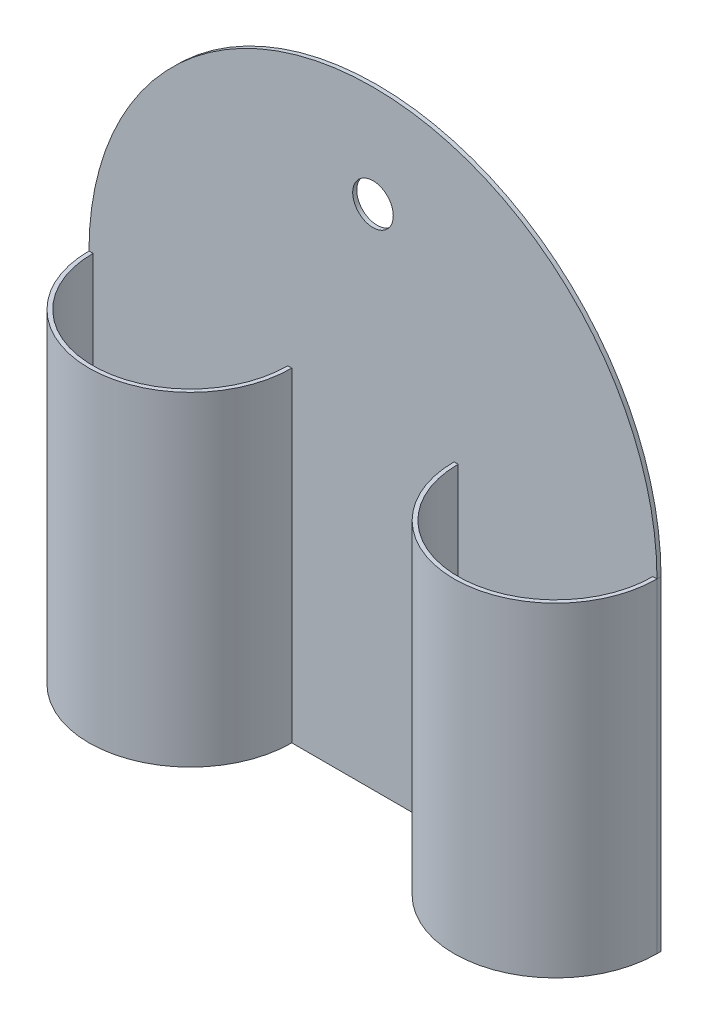
ISO-10303-21;
HEADER;
FILE_DESCRIPTION(('STEP AP214'),'2;1');
FILE_NAME('part.step','',(''),(''),'','','');
FILE_SCHEMA(('AUTOMOTIVE_DESIGN { 1 0 10303 214 1 1 1 1 }'));
ENDSEC;
DATA;
#1=APPLICATION_CONTEXT('core data for automotive mechanical design processes');
#2=APPLICATION_PROTOCOL_DEFINITION('international standard','automotive_design',2000,#1);
#3=PRODUCT_CONTEXT('',#1,'mechanical');
#4=PRODUCT('Part','Part','',(#3));
#5=PRODUCT_RELATED_PRODUCT_CATEGORY('part','',(#4));
#6=PRODUCT_DEFINITION_FORMATION('','',#4);
#7=PRODUCT_DEFINITION_CONTEXT('part definition',#1,'design');
#8=PRODUCT_DEFINITION('design','',#6,#7);
#9=PRODUCT_DEFINITION_SHAPE('','',#8);
#10=(LENGTH_UNIT() NAMED_UNIT(*) SI_UNIT(.MILLI.,.METRE.));
#11=(NAMED_UNIT(*) PLANE_ANGLE_UNIT() SI_UNIT($,.RADIAN.));
#12=(NAMED_UNIT(*) SI_UNIT($,.STERADIAN.) SOLID_ANGLE_UNIT());
#13=UNCERTAINTY_MEASURE_WITH_UNIT(LENGTH_MEASURE(1.E-05),#10,'distance_accuracy_value','');
#14=(GEOMETRIC_REPRESENTATION_CONTEXT(3) GLOBAL_UNCERTAINTY_ASSIGNED_CONTEXT((#13)) GLOBAL_UNIT_ASSIGNED_CONTEXT((#10,
#11,#12)) REPRESENTATION_CONTEXT('',''));
#15=CARTESIAN_POINT('',(0.,0.,0.));
#16=DIRECTION('',(0.,0.,1.));
#17=DIRECTION('',(1.,0.,0.));
#18=AXIS2_PLACEMENT_3D('',#15,#16,#17);
#19=CARTESIAN_POINT('',(70.,80.,1.));
#20=DIRECTION('',(0.,0.,1.));
#21=DIRECTION('',(1.,0.,0.));
#22=AXIS2_PLACEMENT_3D('',#19,#20,#21);
#23=PLANE('',#22);
#24=CARTESIAN_POINT('',(70.,125.,1.));
#25=DIRECTION('',(0.,0.,1.));
#26=DIRECTION('',(1.,0.,0.));
#27=AXIS2_PLACEMENT_3D('',#24,#25,#26);
#28=CIRCLE('',#27,5.00000000000001);
#29=CARTESIAN_POINT('',(75.,125.,1.));
#30=VERTEX_POINT('',#29);
#31=EDGE_CURVE('E161',#30,#30,#28,.T.);
#32=ORIENTED_EDGE('',*,*,#31,.F.);
#33=EDGE_LOOP('',(#32));
#34=FACE_BOUND('',#33,.T.);
#35=DIRECTION('',(1.,0.,0.));
#36=VECTOR('',#35,1.);
#37=CARTESIAN_POINT('',(0.,0.,1.));
#38=LINE('',#37,#36);
#39=CARTESIAN_POINT('',(50.,0.,1.));
#40=VERTEX_POINT('',#39);
#41=CARTESIAN_POINT('',(90.,0.,1.));
#42=VERTEX_POINT('',#41);
#43=EDGE_CURVE('E170',#40,#42,#38,.T.);
#44=ORIENTED_EDGE('',*,*,#43,.T.);
#45=DIRECTION('',(0.,-1.,0.));
#46=VECTOR('',#45,1.);
#47=CARTESIAN_POINT('',(90.,80.,1.));
#48=LINE('',#47,#46);
#49=CARTESIAN_POINT('',(90.,80.,1.));
#50=VERTEX_POINT('',#49);
#51=EDGE_CURVE('E143',#50,#42,#48,.T.);
#52=ORIENTED_EDGE('',*,*,#51,.F.);
#53=DIRECTION('',(-1.,0.,0.));
#54=VECTOR('',#53,1.);
#55=CARTESIAN_POINT('',(90.,80.,1.));
#56=LINE('',#55,#54);
#57=CARTESIAN_POINT('',(91.,80.,1.));
#58=VERTEX_POINT('',#57);
#59=EDGE_CURVE('E139',#58,#50,#56,.T.);
#60=ORIENTED_EDGE('',*,*,#59,.F.);
#61=DIRECTION('',(0.,-1.,0.));
#62=VECTOR('',#61,1.);
#63=CARTESIAN_POINT('',(91.,80.,1.));
#64=LINE('',#63,#62);
#65=CARTESIAN_POINT('',(91.,1.,1.));
#66=VERTEX_POINT('',#65);
#67=EDGE_CURVE('E130',#66,#58,#64,.F.);
#68=ORIENTED_EDGE('',*,*,#67,.F.);
#69=DIRECTION('',(1.,0.,0.));
#70=VECTOR('',#69,1.);
#71=CARTESIAN_POINT('',(0.,1.,1.));
#72=LINE('',#71,#70);
#73=CARTESIAN_POINT('',(139.,1.,1.));
#74=VERTEX_POINT('',#73);
#75=EDGE_CURVE('E123',#66,#74,#72,.T.);
#76=ORIENTED_EDGE('',*,*,#75,.T.);
#77=DIRECTION('',(0.,-1.,0.));
#78=VECTOR('',#77,1.);
#79=CARTESIAN_POINT('',(139.,80.,0.999999999999999));
#80=LINE('',#79,#78);
#81=CARTESIAN_POINT('',(139.,80.,1.));
#82=VERTEX_POINT('',#81);
#83=EDGE_CURVE('E54',#74,#82,#80,.F.);
#84=ORIENTED_EDGE('',*,*,#83,.T.);
#85=CARTESIAN_POINT('',(140.,80.,1.));
#86=VERTEX_POINT('',#85);
#87=EDGE_CURVE('E140',#86,#82,#56,.T.);
#88=ORIENTED_EDGE('',*,*,#87,.F.);
#89=CARTESIAN_POINT('',(70.,80.,1.));
#90=DIRECTION('',(0.,0.,1.));
#91=DIRECTION('',(1.,0.,0.));
#92=AXIS2_PLACEMENT_3D('',#89,#90,#91);
#93=CIRCLE('',#92,70.);
#94=CARTESIAN_POINT('',(0.,80.,1.));
#95=VERTEX_POINT('',#94);
#96=EDGE_CURVE('E176',#86,#95,#93,.T.);
#97=ORIENTED_EDGE('',*,*,#96,.T.);
#98=DIRECTION('',(-1.,0.,0.));
#99=VECTOR('',#98,1.);
#100=CARTESIAN_POINT('',(0.,80.,1.));
#101=LINE('',#100,#99);
#102=CARTESIAN_POINT('',(1.,80.,1.));
#103=VERTEX_POINT('',#102);
#104=EDGE_CURVE('E120',#103,#95,#101,.T.);
#105=ORIENTED_EDGE('',*,*,#104,.F.);
#106=DIRECTION('',(0.,-1.,0.));
#107=VECTOR('',#106,1.);
#108=CARTESIAN_POINT('',(1.,80.,1.));
#109=LINE('',#108,#107);
#110=CARTESIAN_POINT('',(1.,1.,1.));
#111=VERTEX_POINT('',#110);
#112=EDGE_CURVE('E46',#103,#111,#109,.T.);
#113=ORIENTED_EDGE('',*,*,#112,.T.);
#114=CARTESIAN_POINT('',(49.,1.,1.));
#115=VERTEX_POINT('',#114);
#116=EDGE_CURVE('E118',#111,#115,#72,.T.);
#117=ORIENTED_EDGE('',*,*,#116,.T.);
#118=DIRECTION('',(0.,-1.,0.));
#119=VECTOR('',#118,1.);
#120=CARTESIAN_POINT('',(49.,80.,1.));
#121=LINE('',#120,#119);
#122=CARTESIAN_POINT('',(49.,80.,1.));
#123=VERTEX_POINT('',#122);
#124=EDGE_CURVE('E110',#115,#123,#121,.F.);
#125=ORIENTED_EDGE('',*,*,#124,.T.);
#126=CARTESIAN_POINT('',(50.,80.,1.));
#127=VERTEX_POINT('',#126);
#128=EDGE_CURVE('E152',#127,#123,#101,.T.);
#129=ORIENTED_EDGE('',*,*,#128,.F.);
#130=DIRECTION('',(0.,-1.,0.));
#131=VECTOR('',#130,1.);
#132=CARTESIAN_POINT('',(50.,80.,1.));
#133=LINE('',#132,#131);
#134=EDGE_CURVE('E155',#127,#40,#133,.T.);
#135=ORIENTED_EDGE('',*,*,#134,.T.);
#136=EDGE_LOOP('',(#44,#52,#60,#68,#76,#84,#88,#97,#105,#113,#117,#125,#129,#135));
#137=FACE_BOUND('',#136,.T.);
#138=ADVANCED_FACE('F31',(#34,#137),#23,.T.);
#139=CARTESIAN_POINT('',(70.,80.,0.));
#140=DIRECTION('',(0.,0.,1.));
#141=DIRECTION('',(1.,0.,0.));
#142=AXIS2_PLACEMENT_3D('',#139,#140,#141);
#143=PLANE('',#142);
#144=DIRECTION('',(0.,-1.,0.));
#145=VECTOR('',#144,1.);
#146=CARTESIAN_POINT('',(0.,0.,0.));
#147=LINE('',#146,#145);
#148=CARTESIAN_POINT('',(0.,80.,0.));
#149=VERTEX_POINT('',#148);
#150=CARTESIAN_POINT('',(0.,0.,0.));
#151=VERTEX_POINT('',#150);
#152=EDGE_CURVE('E164',#149,#151,#147,.T.);
#153=ORIENTED_EDGE('',*,*,#152,.F.);
#154=CARTESIAN_POINT('',(70.,80.,0.));
#155=DIRECTION('',(0.,0.,1.));
#156=DIRECTION('',(1.,0.,0.));
#157=AXIS2_PLACEMENT_3D('',#154,#155,#156);
#158=CIRCLE('',#157,70.);
#159=CARTESIAN_POINT('',(140.,80.,0.));
#160=VERTEX_POINT('',#159);
#161=EDGE_CURVE('E171',#160,#149,#158,.T.);
#162=ORIENTED_EDGE('',*,*,#161,.F.);
#163=DIRECTION('',(0.,1.,0.));
#164=VECTOR('',#163,1.);
#165=CARTESIAN_POINT('',(140.,0.,0.));
#166=LINE('',#165,#164);
#167=CARTESIAN_POINT('',(140.,0.,0.));
#168=VERTEX_POINT('',#167);
#169=EDGE_CURVE('E183',#168,#160,#166,.T.);
#170=ORIENTED_EDGE('',*,*,#169,.F.);
#171=DIRECTION('',(1.,0.,0.));
#172=VECTOR('',#171,1.);
#173=CARTESIAN_POINT('',(0.,0.,0.));
#174=LINE('',#173,#172);
#175=EDGE_CURVE('E181',#151,#168,#174,.T.);
#176=ORIENTED_EDGE('',*,*,#175,.F.);
#177=EDGE_LOOP('',(#153,#162,#170,#176));
#178=FACE_BOUND('',#177,.T.);
#179=CARTESIAN_POINT('',(70.,125.,0.));
#180=DIRECTION('',(0.,0.,1.));
#181=DIRECTION('',(1.,0.,0.));
#182=AXIS2_PLACEMENT_3D('',#179,#180,#181);
#183=CIRCLE('',#182,5.00000000000001);
#184=CARTESIAN_POINT('',(75.,125.,0.));
#185=VERTEX_POINT('',#184);
#186=EDGE_CURVE('E160',#185,#185,#183,.T.);
#187=ORIENTED_EDGE('',*,*,#186,.T.);
#188=EDGE_LOOP('',(#187));
#189=FACE_BOUND('',#188,.T.);
#190=ADVANCED_FACE('F201',(#178,#189),#143,.F.);
#191=CARTESIAN_POINT('',(0.,0.,1.));
#192=DIRECTION('',(1.,0.,0.));
#193=DIRECTION('',(0.,0.,-1.));
#194=AXIS2_PLACEMENT_3D('',#191,#192,#193);
#195=PLANE('',#194);
#196=ORIENTED_EDGE('',*,*,#152,.T.);
#197=DIRECTION('',(0.,0.,-1.));
#198=VECTOR('',#197,1.);
#199=CARTESIAN_POINT('',(0.,0.,1.));
#200=LINE('',#199,#198);
#201=CARTESIAN_POINT('',(0.,0.,1.));
#202=VERTEX_POINT('',#201);
#203=EDGE_CURVE('E11',#202,#151,#200,.T.);
#204=ORIENTED_EDGE('',*,*,#203,.F.);
#205=DIRECTION('',(0.,-1.,0.));
#206=VECTOR('',#205,1.);
#207=CARTESIAN_POINT('',(0.,0.,1.));
#208=LINE('',#207,#206);
#209=EDGE_CURVE('E167',#95,#202,#208,.T.);
#210=ORIENTED_EDGE('',*,*,#209,.F.);
#211=DIRECTION('',(0.,0.,-1.));
#212=VECTOR('',#211,1.);
#213=CARTESIAN_POINT('',(0.,80.,1.));
#214=LINE('',#213,#212);
#215=EDGE_CURVE('E178',#95,#149,#214,.T.);
#216=ORIENTED_EDGE('',*,*,#215,.T.);
#217=EDGE_LOOP('',(#196,#204,#210,#216));
#218=FACE_BOUND('',#217,.T.);
#219=ADVANCED_FACE('F33',(#218),#195,.F.);
#220=CARTESIAN_POINT('',(0.,0.,1.));
#221=DIRECTION('',(0.,1.,0.));
#222=DIRECTION('',(0.,0.,1.));
#223=AXIS2_PLACEMENT_3D('',#220,#221,#222);
#224=PLANE('',#223);
#225=ORIENTED_EDGE('',*,*,#175,.T.);
#226=DIRECTION('',(0.,0.,-1.));
#227=VECTOR('',#226,1.);
#228=CARTESIAN_POINT('',(140.,0.,1.));
#229=LINE('',#228,#227);
#230=CARTESIAN_POINT('',(140.,0.,1.));
#231=VERTEX_POINT('',#230);
#232=EDGE_CURVE('E39',#231,#168,#229,.T.);
#233=ORIENTED_EDGE('',*,*,#232,.F.);
#234=CARTESIAN_POINT('',(115.,0.,1.));
#235=DIRECTION('',(0.,1.,0.));
#236=DIRECTION('',(0.,0.,1.));
#237=AXIS2_PLACEMENT_3D('',#234,#235,#236);
#238=CIRCLE('',#237,25.);
#239=EDGE_CURVE('E135',#42,#231,#238,.T.);
#240=ORIENTED_EDGE('',*,*,#239,.F.);
#241=ORIENTED_EDGE('',*,*,#43,.F.);
#242=CARTESIAN_POINT('',(25.,0.,1.));
#243=DIRECTION('',(0.,1.,0.));
#244=DIRECTION('',(0.,0.,1.));
#245=AXIS2_PLACEMENT_3D('',#242,#243,#244);
#246=CIRCLE('',#245,25.);
#247=EDGE_CURVE('E148',#202,#40,#246,.T.);
#248=ORIENTED_EDGE('',*,*,#247,.F.);
#249=ORIENTED_EDGE('',*,*,#203,.T.);
#250=EDGE_LOOP('',(#225,#233,#240,#241,#248,#249));
#251=FACE_BOUND('',#250,.T.);
#252=ADVANCED_FACE('F223',(#251),#224,.F.);
#253=CARTESIAN_POINT('',(140.,0.,1.));
#254=DIRECTION('',(-1.,0.,0.));
#255=DIRECTION('',(0.,0.,1.));
#256=AXIS2_PLACEMENT_3D('',#253,#254,#255);
#257=PLANE('',#256);
#258=ORIENTED_EDGE('',*,*,#169,.T.);
#259=DIRECTION('',(0.,0.,-1.));
#260=VECTOR('',#259,1.);
#261=CARTESIAN_POINT('',(140.,80.,1.));
#262=LINE('',#261,#260);
#263=EDGE_CURVE('E188',#86,#160,#262,.T.);
#264=ORIENTED_EDGE('',*,*,#263,.F.);
#265=DIRECTION('',(0.,1.,0.));
#266=VECTOR('',#265,1.);
#267=CARTESIAN_POINT('',(140.,0.,1.));
#268=LINE('',#267,#266);
#269=EDGE_CURVE('E173',#231,#86,#268,.T.);
#270=ORIENTED_EDGE('',*,*,#269,.F.);
#271=ORIENTED_EDGE('',*,*,#232,.T.);
#272=EDGE_LOOP('',(#258,#264,#270,#271));
#273=FACE_BOUND('',#272,.T.);
#274=ADVANCED_FACE('F194',(#273),#257,.F.);
#275=CARTESIAN_POINT('',(70.,80.,1.));
#276=DIRECTION('',(0.,0.,-1.));
#277=DIRECTION('',(-1.,0.,0.));
#278=AXIS2_PLACEMENT_3D('',#275,#276,#277);
#279=CYLINDRICAL_SURFACE('',#278,70.);
#280=ORIENTED_EDGE('',*,*,#161,.T.);
#281=ORIENTED_EDGE('',*,*,#215,.F.);
#282=ORIENTED_EDGE('',*,*,#96,.F.);
#283=ORIENTED_EDGE('',*,*,#263,.T.);
#284=EDGE_LOOP('',(#280,#281,#282,#283));
#285=FACE_BOUND('',#284,.T.);
#286=ADVANCED_FACE('F205',(#285),#279,.T.);
#287=CARTESIAN_POINT('',(70.,125.,1.));
#288=DIRECTION('',(0.,0.,-1.));
#289=DIRECTION('',(-1.,0.,0.));
#290=AXIS2_PLACEMENT_3D('',#287,#288,#289);
#291=CYLINDRICAL_SURFACE('',#290,5.00000000000001);
#292=ORIENTED_EDGE('',*,*,#31,.T.);
#293=EDGE_LOOP('',(#292));
#294=FACE_BOUND('',#293,.T.);
#295=ORIENTED_EDGE('',*,*,#186,.F.);
#296=EDGE_LOOP('',(#295));
#297=FACE_BOUND('',#296,.T.);
#298=ADVANCED_FACE('F248',(#294,#297),#291,.F.);
#299=CARTESIAN_POINT('',(25.,80.,1.));
#300=DIRECTION('',(0.,-1.,0.));
#301=DIRECTION('',(0.,0.,-1.));
#302=AXIS2_PLACEMENT_3D('',#299,#300,#301);
#303=CYLINDRICAL_SURFACE('',#302,25.);
#304=ORIENTED_EDGE('',*,*,#247,.T.);
#305=ORIENTED_EDGE('',*,*,#134,.F.);
#306=CARTESIAN_POINT('',(25.,80.,1.));
#307=DIRECTION('',(0.,1.,0.));
#308=DIRECTION('',(0.,0.,1.));
#309=AXIS2_PLACEMENT_3D('',#306,#307,#308);
#310=CIRCLE('',#309,25.);
#311=EDGE_CURVE('E149',#95,#127,#310,.T.);
#312=ORIENTED_EDGE('',*,*,#311,.F.);
#313=ORIENTED_EDGE('',*,*,#209,.T.);
#314=EDGE_LOOP('',(#304,#305,#312,#313));
#315=FACE_BOUND('',#314,.T.);
#316=ADVANCED_FACE('F212',(#315),#303,.T.);
#317=CARTESIAN_POINT('',(25.,80.,1.));
#318=DIRECTION('',(0.,1.,0.));
#319=DIRECTION('',(0.,0.,1.));
#320=AXIS2_PLACEMENT_3D('',#317,#318,#319);
#321=PLANE('',#320);
#322=CARTESIAN_POINT('',(25.,80.,1.));
#323=DIRECTION('',(0.,1.,0.));
#324=DIRECTION('',(0.,0.,1.));
#325=AXIS2_PLACEMENT_3D('',#322,#323,#324);
#326=CIRCLE('',#325,24.);
#327=EDGE_CURVE('E114',#103,#123,#326,.T.);
#328=ORIENTED_EDGE('',*,*,#327,.F.);
#329=ORIENTED_EDGE('',*,*,#104,.T.);
#330=ORIENTED_EDGE('',*,*,#311,.T.);
#331=ORIENTED_EDGE('',*,*,#128,.T.);
#332=EDGE_LOOP('',(#328,#329,#330,#331));
#333=FACE_BOUND('',#332,.T.);
#334=ADVANCED_FACE('F214',(#333),#321,.T.);
#335=CARTESIAN_POINT('',(115.,80.,1.));
#336=DIRECTION('',(0.,-1.,0.));
#337=DIRECTION('',(0.,0.,-1.));
#338=AXIS2_PLACEMENT_3D('',#335,#336,#337);
#339=CYLINDRICAL_SURFACE('',#338,25.);
#340=ORIENTED_EDGE('',*,*,#239,.T.);
#341=ORIENTED_EDGE('',*,*,#269,.T.);
#342=CARTESIAN_POINT('',(115.,80.,1.));
#343=DIRECTION('',(0.,1.,0.));
#344=DIRECTION('',(0.,0.,1.));
#345=AXIS2_PLACEMENT_3D('',#342,#343,#344);
#346=CIRCLE('',#345,25.);
#347=EDGE_CURVE('E136',#50,#86,#346,.T.);
#348=ORIENTED_EDGE('',*,*,#347,.F.);
#349=ORIENTED_EDGE('',*,*,#51,.T.);
#350=EDGE_LOOP('',(#340,#341,#348,#349));
#351=FACE_BOUND('',#350,.T.);
#352=ADVANCED_FACE('F222',(#351),#339,.T.);
#353=CARTESIAN_POINT('',(115.,80.,1.));
#354=DIRECTION('',(0.,1.,0.));
#355=DIRECTION('',(0.,0.,1.));
#356=AXIS2_PLACEMENT_3D('',#353,#354,#355);
#357=PLANE('',#356);
#358=CARTESIAN_POINT('',(115.,80.,1.));
#359=DIRECTION('',(0.,1.,0.));
#360=DIRECTION('',(0.,0.,1.));
#361=AXIS2_PLACEMENT_3D('',#358,#359,#360);
#362=CIRCLE('',#361,24.);
#363=EDGE_CURVE('E115',#58,#82,#362,.T.);
#364=ORIENTED_EDGE('',*,*,#363,.F.);
#365=ORIENTED_EDGE('',*,*,#59,.T.);
#366=ORIENTED_EDGE('',*,*,#347,.T.);
#367=ORIENTED_EDGE('',*,*,#87,.T.);
#368=EDGE_LOOP('',(#364,#365,#366,#367));
#369=FACE_BOUND('',#368,.T.);
#370=ADVANCED_FACE('F218',(#369),#357,.T.);
#371=CARTESIAN_POINT('',(0.,1.,1.));
#372=DIRECTION('',(0.,1.,0.));
#373=DIRECTION('',(0.,0.,1.));
#374=AXIS2_PLACEMENT_3D('',#371,#372,#373);
#375=PLANE('',#374);
#376=CARTESIAN_POINT('',(115.,1.,1.));
#377=DIRECTION('',(0.,1.,0.));
#378=DIRECTION('',(0.,0.,1.));
#379=AXIS2_PLACEMENT_3D('',#376,#377,#378);
#380=CIRCLE('',#379,24.);
#381=EDGE_CURVE('E126',#66,#74,#380,.T.);
#382=ORIENTED_EDGE('',*,*,#381,.T.);
#383=ORIENTED_EDGE('',*,*,#75,.F.);
#384=EDGE_LOOP('',(#382,#383));
#385=FACE_BOUND('',#384,.T.);
#386=ADVANCED_FACE('F228',(#385),#375,.T.);
#387=CARTESIAN_POINT('',(115.,80.,1.));
#388=DIRECTION('',(0.,-1.,0.));
#389=DIRECTION('',(0.,0.,-1.));
#390=AXIS2_PLACEMENT_3D('',#387,#388,#389);
#391=CYLINDRICAL_SURFACE('',#390,24.);
#392=ORIENTED_EDGE('',*,*,#67,.T.);
#393=ORIENTED_EDGE('',*,*,#363,.T.);
#394=ORIENTED_EDGE('',*,*,#83,.F.);
#395=ORIENTED_EDGE('',*,*,#381,.F.);
#396=EDGE_LOOP('',(#392,#393,#394,#395));
#397=FACE_BOUND('',#396,.T.);
#398=ADVANCED_FACE('F229',(#397),#391,.F.);
#399=CARTESIAN_POINT('',(25.,80.,1.));
#400=DIRECTION('',(0.,-1.,0.));
#401=DIRECTION('',(0.,0.,-1.));
#402=AXIS2_PLACEMENT_3D('',#399,#400,#401);
#403=CYLINDRICAL_SURFACE('',#402,24.);
#404=CARTESIAN_POINT('',(25.,1.,1.));
#405=DIRECTION('',(0.,1.,0.));
#406=DIRECTION('',(0.,0.,1.));
#407=AXIS2_PLACEMENT_3D('',#404,#405,#406);
#408=CIRCLE('',#407,24.);
#409=EDGE_CURVE('E108',#111,#115,#408,.T.);
#410=ORIENTED_EDGE('',*,*,#409,.F.);
#411=ORIENTED_EDGE('',*,*,#112,.F.);
#412=ORIENTED_EDGE('',*,*,#327,.T.);
#413=ORIENTED_EDGE('',*,*,#124,.F.);
#414=EDGE_LOOP('',(#410,#411,#412,#413));
#415=FACE_BOUND('',#414,.T.);
#416=ADVANCED_FACE('F109',(#415),#403,.F.);
#417=ORIENTED_EDGE('',*,*,#116,.F.);
#418=ORIENTED_EDGE('',*,*,#409,.T.);
#419=EDGE_LOOP('',(#417,#418));
#420=FACE_BOUND('',#419,.T.);
#421=ADVANCED_FACE('F122',(#420),#375,.T.);
#422=CLOSED_SHELL('',(#138,#190,#219,#252,#274,#286,#298,#316,#334,#352,#370,#386,#398,#416,#421));
#423=MANIFOLD_SOLID_BREP('B2',#422);
#424=ADVANCED_BREP_SHAPE_REPRESENTATION('',(#18,#423),#14);
#425=SHAPE_DEFINITION_REPRESENTATION(#9,#424);
ENDSEC;
END-ISO-10303-21;
